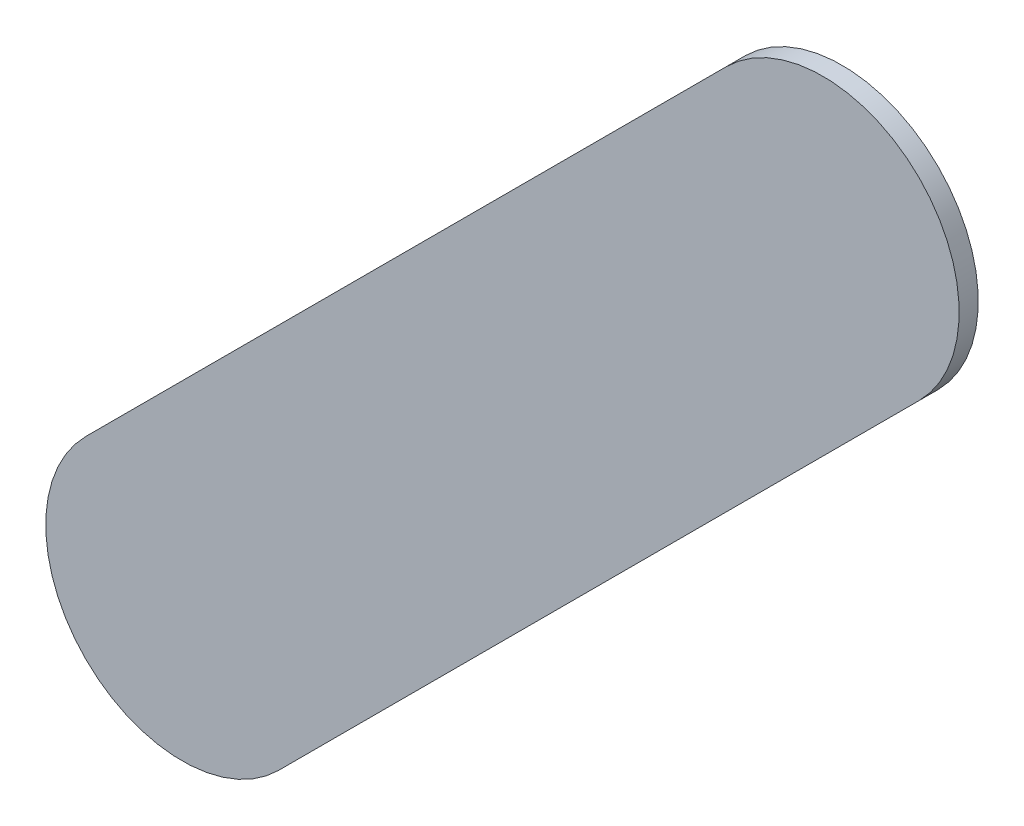
ISO-10303-21;
HEADER;
FILE_DESCRIPTION(('STEP AP214'),'2;1');
FILE_NAME('part.step','',(''),(''),'','','');
FILE_SCHEMA(('AUTOMOTIVE_DESIGN { 1 0 10303 214 1 1 1 1 }'));
ENDSEC;
DATA;
#1=APPLICATION_CONTEXT('core data for automotive mechanical design processes');
#2=APPLICATION_PROTOCOL_DEFINITION('international standard','automotive_design',2000,#1);
#3=PRODUCT_CONTEXT('',#1,'mechanical');
#4=PRODUCT('Part','Part','',(#3));
#5=PRODUCT_RELATED_PRODUCT_CATEGORY('part','',(#4));
#6=PRODUCT_DEFINITION_FORMATION('','',#4);
#7=PRODUCT_DEFINITION_CONTEXT('part definition',#1,'design');
#8=PRODUCT_DEFINITION('design','',#6,#7);
#9=PRODUCT_DEFINITION_SHAPE('','',#8);
#10=(LENGTH_UNIT() NAMED_UNIT(*) SI_UNIT(.MILLI.,.METRE.));
#11=(NAMED_UNIT(*) PLANE_ANGLE_UNIT() SI_UNIT($,.RADIAN.));
#12=(NAMED_UNIT(*) SI_UNIT($,.STERADIAN.) SOLID_ANGLE_UNIT());
#13=UNCERTAINTY_MEASURE_WITH_UNIT(LENGTH_MEASURE(1.E-05),#10,'distance_accuracy_value','');
#14=(GEOMETRIC_REPRESENTATION_CONTEXT(3) GLOBAL_UNCERTAINTY_ASSIGNED_CONTEXT((#13)) GLOBAL_UNIT_ASSIGNED_CONTEXT((#10,
#11,#12)) REPRESENTATION_CONTEXT('',''));
#15=CARTESIAN_POINT('',(0.,0.,0.));
#16=DIRECTION('',(0.,0.,1.));
#17=DIRECTION('',(1.,0.,0.));
#18=AXIS2_PLACEMENT_3D('',#15,#16,#17);
#19=CARTESIAN_POINT('',(177.436776,-116.540776,0.));
#20=DIRECTION('',(0.,0.,1.));
#21=DIRECTION('',(1.,0.,0.));
#22=AXIS2_PLACEMENT_3D('',#19,#20,#21);
#23=PLANE('',#22);
#24=DIRECTION('',(0.707106781186548,0.707106781186548,0.));
#25=VECTOR('',#24,1.);
#26=CARTESIAN_POINT('',(177.436776,-116.540776,0.));
#27=LINE('',#26,#25);
#28=CARTESIAN_POINT('',(177.436776,-116.540776,0.));
#29=VERTEX_POINT('',#28);
#30=CARTESIAN_POINT('',(178.611776,-115.365776,0.));
#31=VERTEX_POINT('',#30);
#32=EDGE_CURVE('E79',#29,#31,#27,.T.);
#33=ORIENTED_EDGE('',*,*,#32,.T.);
#34=CARTESIAN_POINT('',(178.4349995,-115.1889995,0.));
#35=DIRECTION('',(0.,0.,1.));
#36=DIRECTION('',(0.707106781186548,-0.707106781186548,0.));
#37=AXIS2_PLACEMENT_3D('',#34,#35,#36);
#38=CIRCLE('',#37,0.249999723809);
#39=CARTESIAN_POINT('',(178.258223,-115.012223,0.));
#40=VERTEX_POINT('',#39);
#41=EDGE_CURVE('E77',#31,#40,#38,.T.);
#42=ORIENTED_EDGE('',*,*,#41,.T.);
#43=DIRECTION('',(-0.707106781186548,-0.707106781186548,0.));
#44=VECTOR('',#43,1.);
#45=CARTESIAN_POINT('',(178.258223,-115.012223,0.));
#46=LINE('',#45,#44);
#47=CARTESIAN_POINT('',(177.083223,-116.187223,0.));
#48=VERTEX_POINT('',#47);
#49=EDGE_CURVE('E65',#40,#48,#46,.T.);
#50=ORIENTED_EDGE('',*,*,#49,.T.);
#51=CARTESIAN_POINT('',(177.2599995,-116.3639995,0.));
#52=DIRECTION('',(0.,0.,1.));
#53=DIRECTION('',(-0.707106781186548,0.707106781186548,0.));
#54=AXIS2_PLACEMENT_3D('',#51,#52,#53);
#55=CIRCLE('',#54,0.249999723809);
#56=EDGE_CURVE('E11',#48,#29,#55,.T.);
#57=ORIENTED_EDGE('',*,*,#56,.T.);
#58=EDGE_LOOP('',(#33,#42,#50,#57));
#59=FACE_BOUND('',#58,.T.);
#60=ADVANCED_FACE('F17',(#59),#23,.T.);
#61=CARTESIAN_POINT('',(177.436776,-116.540776,-0.035));
#62=DIRECTION('',(0.,0.,1.));
#63=DIRECTION('',(1.,0.,0.));
#64=AXIS2_PLACEMENT_3D('',#61,#62,#63);
#65=PLANE('',#64);
#66=CARTESIAN_POINT('',(177.2599995,-116.3639995,-0.035));
#67=DIRECTION('',(0.,0.,1.));
#68=DIRECTION('',(-0.707106781186548,0.707106781186548,0.));
#69=AXIS2_PLACEMENT_3D('',#66,#67,#68);
#70=CIRCLE('',#69,0.249999723809);
#71=CARTESIAN_POINT('',(177.083223,-116.187223,-0.035));
#72=VERTEX_POINT('',#71);
#73=CARTESIAN_POINT('',(177.436776,-116.540776,-0.035));
#74=VERTEX_POINT('',#73);
#75=EDGE_CURVE('E26',#72,#74,#70,.T.);
#76=ORIENTED_EDGE('',*,*,#75,.F.);
#77=DIRECTION('',(-0.707106781186548,-0.707106781186548,0.));
#78=VECTOR('',#77,1.);
#79=CARTESIAN_POINT('',(178.258223,-115.012223,-0.035));
#80=LINE('',#79,#78);
#81=CARTESIAN_POINT('',(178.258223,-115.012223,-0.035));
#82=VERTEX_POINT('',#81);
#83=EDGE_CURVE('E84',#82,#72,#80,.T.);
#84=ORIENTED_EDGE('',*,*,#83,.F.);
#85=CARTESIAN_POINT('',(178.4349995,-115.1889995,-0.035));
#86=DIRECTION('',(0.,0.,1.));
#87=DIRECTION('',(0.707106781186548,-0.707106781186548,0.));
#88=AXIS2_PLACEMENT_3D('',#85,#86,#87);
#89=CIRCLE('',#88,0.249999723809);
#90=CARTESIAN_POINT('',(178.611776,-115.365776,-0.035));
#91=VERTEX_POINT('',#90);
#92=EDGE_CURVE('E87',#91,#82,#89,.T.);
#93=ORIENTED_EDGE('',*,*,#92,.F.);
#94=DIRECTION('',(0.707106781186548,0.707106781186548,0.));
#95=VECTOR('',#94,1.);
#96=CARTESIAN_POINT('',(177.436776,-116.540776,-0.035));
#97=LINE('',#96,#95);
#98=EDGE_CURVE('E100',#74,#91,#97,.T.);
#99=ORIENTED_EDGE('',*,*,#98,.F.);
#100=EDGE_LOOP('',(#76,#84,#93,#99));
#101=FACE_BOUND('',#100,.T.);
#102=ADVANCED_FACE('F120',(#101),#65,.F.);
#103=CARTESIAN_POINT('',(177.2599995,-116.3639995,-0.035));
#104=DIRECTION('',(0.,0.,-1.));
#105=DIRECTION('',(-0.707106781186548,0.707106781186548,0.));
#106=AXIS2_PLACEMENT_3D('',#103,#104,#105);
#107=CYLINDRICAL_SURFACE('',#106,0.249999723809);
#108=ORIENTED_EDGE('',*,*,#75,.T.);
#109=DIRECTION('',(0.,0.,1.));
#110=VECTOR('',#109,1.);
#111=CARTESIAN_POINT('',(177.436776,-116.540776,-0.035));
#112=LINE('',#111,#110);
#113=EDGE_CURVE('E94',#74,#29,#112,.T.);
#114=ORIENTED_EDGE('',*,*,#113,.T.);
#115=ORIENTED_EDGE('',*,*,#56,.F.);
#116=DIRECTION('',(0.,0.,1.));
#117=VECTOR('',#116,1.);
#118=CARTESIAN_POINT('',(177.083223,-116.187223,-0.035));
#119=LINE('',#118,#117);
#120=EDGE_CURVE('E72',#72,#48,#119,.T.);
#121=ORIENTED_EDGE('',*,*,#120,.F.);
#122=EDGE_LOOP('',(#108,#114,#115,#121));
#123=FACE_BOUND('',#122,.T.);
#124=ADVANCED_FACE('F115',(#123),#107,.T.);
#125=CARTESIAN_POINT('',(178.258223,-115.012223,-0.035));
#126=DIRECTION('',(0.707106781186548,-0.707106781186548,0.));
#127=DIRECTION('',(0.,0.,-1.));
#128=AXIS2_PLACEMENT_3D('',#125,#126,#127);
#129=PLANE('',#128);
#130=ORIENTED_EDGE('',*,*,#83,.T.);
#131=ORIENTED_EDGE('',*,*,#120,.T.);
#132=ORIENTED_EDGE('',*,*,#49,.F.);
#133=DIRECTION('',(0.,0.,1.));
#134=VECTOR('',#133,1.);
#135=CARTESIAN_POINT('',(178.258223,-115.012223,-0.035));
#136=LINE('',#135,#134);
#137=EDGE_CURVE('E70',#82,#40,#136,.T.);
#138=ORIENTED_EDGE('',*,*,#137,.F.);
#139=EDGE_LOOP('',(#130,#131,#132,#138));
#140=FACE_BOUND('',#139,.T.);
#141=ADVANCED_FACE('F68',(#140),#129,.F.);
#142=CARTESIAN_POINT('',(178.4349995,-115.1889995,-0.035));
#143=DIRECTION('',(0.,0.,-1.));
#144=DIRECTION('',(0.707106781186548,-0.707106781186548,0.));
#145=AXIS2_PLACEMENT_3D('',#142,#143,#144);
#146=CYLINDRICAL_SURFACE('',#145,0.249999723809);
#147=ORIENTED_EDGE('',*,*,#92,.T.);
#148=ORIENTED_EDGE('',*,*,#137,.T.);
#149=ORIENTED_EDGE('',*,*,#41,.F.);
#150=DIRECTION('',(0.,0.,1.));
#151=VECTOR('',#150,1.);
#152=CARTESIAN_POINT('',(178.611776,-115.365776,-0.035));
#153=LINE('',#152,#151);
#154=EDGE_CURVE('E97',#91,#31,#153,.T.);
#155=ORIENTED_EDGE('',*,*,#154,.F.);
#156=EDGE_LOOP('',(#147,#148,#149,#155));
#157=FACE_BOUND('',#156,.T.);
#158=ADVANCED_FACE('F86',(#157),#146,.T.);
#159=CARTESIAN_POINT('',(177.436776,-116.540776,-0.035));
#160=DIRECTION('',(-0.707106781186548,0.707106781186548,0.));
#161=DIRECTION('',(0.,0.,1.));
#162=AXIS2_PLACEMENT_3D('',#159,#160,#161);
#163=PLANE('',#162);
#164=ORIENTED_EDGE('',*,*,#98,.T.);
#165=ORIENTED_EDGE('',*,*,#154,.T.);
#166=ORIENTED_EDGE('',*,*,#32,.F.);
#167=ORIENTED_EDGE('',*,*,#113,.F.);
#168=EDGE_LOOP('',(#164,#165,#166,#167));
#169=FACE_BOUND('',#168,.T.);
#170=ADVANCED_FACE('F119',(#169),#163,.F.);
#171=CLOSED_SHELL('',(#60,#102,#124,#141,#158,#170));
#172=MANIFOLD_SOLID_BREP('B1',#171);
#173=ADVANCED_BREP_SHAPE_REPRESENTATION('',(#18,#172),#14);
#174=SHAPE_DEFINITION_REPRESENTATION(#9,#173);
ENDSEC;
END-ISO-10303-21;
